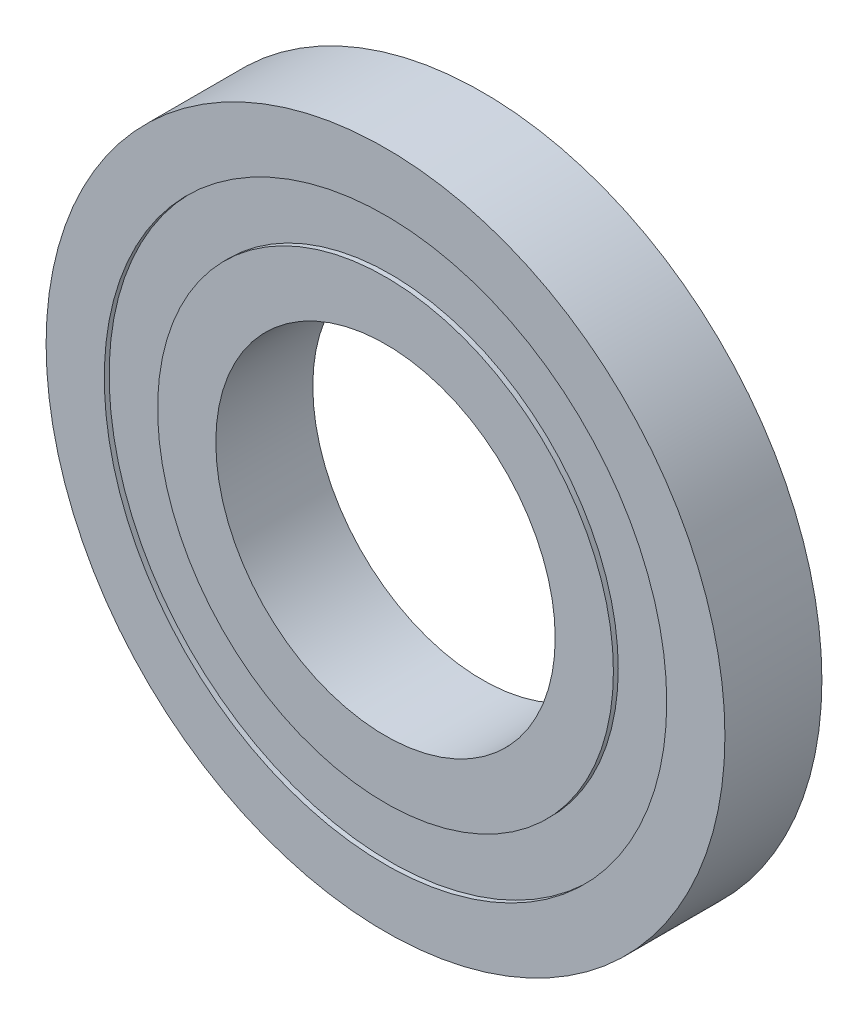
ISO-10303-21;
HEADER;
FILE_DESCRIPTION(('STEP AP214'),'2;1');
FILE_NAME('part.step','',(''),(''),'','','');
FILE_SCHEMA(('AUTOMOTIVE_DESIGN { 1 0 10303 214 1 1 1 1 }'));
ENDSEC;
DATA;
#1=APPLICATION_CONTEXT('core data for automotive mechanical design processes');
#2=APPLICATION_PROTOCOL_DEFINITION('international standard','automotive_design',2000,#1);
#3=PRODUCT_CONTEXT('',#1,'mechanical');
#4=PRODUCT('Part','Part','',(#3));
#5=PRODUCT_RELATED_PRODUCT_CATEGORY('part','',(#4));
#6=PRODUCT_DEFINITION_FORMATION('','',#4);
#7=PRODUCT_DEFINITION_CONTEXT('part definition',#1,'design');
#8=PRODUCT_DEFINITION('design','',#6,#7);
#9=PRODUCT_DEFINITION_SHAPE('','',#8);
#10=(LENGTH_UNIT() NAMED_UNIT(*) SI_UNIT(.MILLI.,.METRE.));
#11=(NAMED_UNIT(*) PLANE_ANGLE_UNIT() SI_UNIT($,.RADIAN.));
#12=(NAMED_UNIT(*) SI_UNIT($,.STERADIAN.) SOLID_ANGLE_UNIT());
#13=UNCERTAINTY_MEASURE_WITH_UNIT(LENGTH_MEASURE(1.E-05),#10,'distance_accuracy_value','');
#14=(GEOMETRIC_REPRESENTATION_CONTEXT(3) GLOBAL_UNCERTAINTY_ASSIGNED_CONTEXT((#13)) GLOBAL_UNIT_ASSIGNED_CONTEXT((#10,
#11,#12)) REPRESENTATION_CONTEXT('',''));
#15=CARTESIAN_POINT('',(0.,0.,0.));
#16=DIRECTION('',(0.,0.,1.));
#17=DIRECTION('',(1.,0.,0.));
#18=AXIS2_PLACEMENT_3D('',#15,#16,#17);
#19=CARTESIAN_POINT('',(0.,0.,10.));
#20=DIRECTION('',(0.,0.,-1.));
#21=DIRECTION('',(-1.,0.,0.));
#22=AXIS2_PLACEMENT_3D('',#19,#20,#21);
#23=CYLINDRICAL_SURFACE('',#22,23.5);
#24=CARTESIAN_POINT('',(0.,0.,0.));
#25=DIRECTION('',(0.,0.,1.));
#26=DIRECTION('',(1.,0.,0.));
#27=AXIS2_PLACEMENT_3D('',#24,#25,#26);
#28=CIRCLE('',#27,23.5);
#29=CARTESIAN_POINT('',(23.5,0.,0.));
#30=VERTEX_POINT('',#29);
#31=EDGE_CURVE('E61',#30,#30,#28,.T.);
#32=ORIENTED_EDGE('',*,*,#31,.T.);
#33=EDGE_LOOP('',(#32));
#34=FACE_BOUND('',#33,.T.);
#35=CARTESIAN_POINT('',(0.,0.,0.5));
#36=DIRECTION('',(0.,0.,1.));
#37=DIRECTION('',(1.,0.,0.));
#38=AXIS2_PLACEMENT_3D('',#35,#36,#37);
#39=CIRCLE('',#38,23.5);
#40=CARTESIAN_POINT('',(23.5,0.,0.5));
#41=VERTEX_POINT('',#40);
#42=EDGE_CURVE('E11',#41,#41,#39,.T.);
#43=ORIENTED_EDGE('',*,*,#42,.F.);
#44=EDGE_LOOP('',(#43));
#45=FACE_BOUND('',#44,.T.);
#46=ADVANCED_FACE('F45',(#34,#45),#23,.T.);
#47=CARTESIAN_POINT('',(0.,0.,10.));
#48=DIRECTION('',(0.,0.,-1.));
#49=DIRECTION('',(-1.,0.,0.));
#50=AXIS2_PLACEMENT_3D('',#47,#48,#49);
#51=CYLINDRICAL_SURFACE('',#50,17.5);
#52=CARTESIAN_POINT('',(0.,0.,10.));
#53=DIRECTION('',(0.,0.,1.));
#54=DIRECTION('',(1.,0.,0.));
#55=AXIS2_PLACEMENT_3D('',#52,#53,#54);
#56=CIRCLE('',#55,17.5);
#57=CARTESIAN_POINT('',(17.5,0.,10.));
#58=VERTEX_POINT('',#57);
#59=EDGE_CURVE('E56',#58,#58,#56,.T.);
#60=ORIENTED_EDGE('',*,*,#59,.T.);
#61=EDGE_LOOP('',(#60));
#62=FACE_BOUND('',#61,.T.);
#63=CARTESIAN_POINT('',(0.,0.,0.));
#64=DIRECTION('',(0.,0.,1.));
#65=DIRECTION('',(1.,0.,0.));
#66=AXIS2_PLACEMENT_3D('',#63,#64,#65);
#67=CIRCLE('',#66,17.5);
#68=CARTESIAN_POINT('',(17.5,0.,0.));
#69=VERTEX_POINT('',#68);
#70=EDGE_CURVE('E65',#69,#69,#67,.T.);
#71=ORIENTED_EDGE('',*,*,#70,.F.);
#72=EDGE_LOOP('',(#71));
#73=FACE_BOUND('',#72,.T.);
#74=ADVANCED_FACE('F47',(#62,#73),#51,.F.);
#75=CARTESIAN_POINT('',(0.,0.,9.5));
#76=DIRECTION('',(0.,0.,1.));
#77=DIRECTION('',(1.,0.,0.));
#78=AXIS2_PLACEMENT_3D('',#75,#76,#77);
#79=CIRCLE('',#78,23.5);
#80=CARTESIAN_POINT('',(23.5,0.,9.5));
#81=VERTEX_POINT('',#80);
#82=EDGE_CURVE('E67',#81,#81,#79,.T.);
#83=ORIENTED_EDGE('',*,*,#82,.T.);
#84=EDGE_LOOP('',(#83));
#85=FACE_BOUND('',#84,.T.);
#86=CARTESIAN_POINT('',(0.,0.,10.));
#87=DIRECTION('',(0.,0.,1.));
#88=DIRECTION('',(1.,0.,0.));
#89=AXIS2_PLACEMENT_3D('',#86,#87,#88);
#90=CIRCLE('',#89,23.5);
#91=CARTESIAN_POINT('',(23.5,0.,10.));
#92=VERTEX_POINT('',#91);
#93=EDGE_CURVE('E52',#92,#92,#90,.T.);
#94=ORIENTED_EDGE('',*,*,#93,.F.);
#95=EDGE_LOOP('',(#94));
#96=FACE_BOUND('',#95,.T.);
#97=ADVANCED_FACE('F87',(#85,#96),#23,.T.);
#98=CARTESIAN_POINT('',(0.,0.,10.));
#99=DIRECTION('',(0.,0.,1.));
#100=DIRECTION('',(1.,0.,0.));
#101=AXIS2_PLACEMENT_3D('',#98,#99,#100);
#102=PLANE('',#101);
#103=ORIENTED_EDGE('',*,*,#59,.F.);
#104=EDGE_LOOP('',(#103));
#105=FACE_BOUND('',#104,.T.);
#106=ORIENTED_EDGE('',*,*,#93,.T.);
#107=EDGE_LOOP('',(#106));
#108=FACE_BOUND('',#107,.T.);
#109=ADVANCED_FACE('F76',(#105,#108),#102,.T.);
#110=CARTESIAN_POINT('',(0.,0.,0.));
#111=DIRECTION('',(0.,0.,1.));
#112=DIRECTION('',(1.,0.,0.));
#113=AXIS2_PLACEMENT_3D('',#110,#111,#112);
#114=PLANE('',#113);
#115=ORIENTED_EDGE('',*,*,#70,.T.);
#116=EDGE_LOOP('',(#115));
#117=FACE_BOUND('',#116,.T.);
#118=ORIENTED_EDGE('',*,*,#31,.F.);
#119=EDGE_LOOP('',(#118));
#120=FACE_BOUND('',#119,.T.);
#121=ADVANCED_FACE('F73',(#117,#120),#114,.F.);
#122=CARTESIAN_POINT('',(0.,0.,9.5));
#123=DIRECTION('',(0.,0.,1.));
#124=DIRECTION('',(1.,0.,0.));
#125=AXIS2_PLACEMENT_3D('',#122,#123,#124);
#126=PLANE('',#125);
#127=ORIENTED_EDGE('',*,*,#82,.F.);
#128=EDGE_LOOP('',(#127));
#129=FACE_BOUND('',#128,.T.);
#130=CARTESIAN_POINT('',(0.,0.,9.5));
#131=DIRECTION('',(0.,0.,1.));
#132=DIRECTION('',(1.,0.,0.));
#133=AXIS2_PLACEMENT_3D('',#130,#131,#132);
#134=CIRCLE('',#133,29.);
#135=CARTESIAN_POINT('',(29.,0.,9.5));
#136=VERTEX_POINT('',#135);
#137=EDGE_CURVE('E104',#136,#136,#134,.F.);
#138=ORIENTED_EDGE('',*,*,#137,.F.);
#139=EDGE_LOOP('',(#138));
#140=FACE_BOUND('',#139,.T.);
#141=ADVANCED_FACE('F75',(#129,#140),#126,.T.);
#142=CARTESIAN_POINT('',(0.,0.,0.5));
#143=DIRECTION('',(0.,0.,1.));
#144=DIRECTION('',(1.,0.,0.));
#145=AXIS2_PLACEMENT_3D('',#142,#143,#144);
#146=PLANE('',#145);
#147=ORIENTED_EDGE('',*,*,#42,.T.);
#148=EDGE_LOOP('',(#147));
#149=FACE_BOUND('',#148,.T.);
#150=CARTESIAN_POINT('',(0.,0.,0.5));
#151=DIRECTION('',(0.,0.,1.));
#152=DIRECTION('',(1.,0.,0.));
#153=AXIS2_PLACEMENT_3D('',#150,#151,#152);
#154=CIRCLE('',#153,29.);
#155=CARTESIAN_POINT('',(29.,0.,0.5));
#156=VERTEX_POINT('',#155);
#157=EDGE_CURVE('E101',#156,#156,#154,.T.);
#158=ORIENTED_EDGE('',*,*,#157,.F.);
#159=EDGE_LOOP('',(#158));
#160=FACE_BOUND('',#159,.T.);
#161=ADVANCED_FACE('F84',(#149,#160),#146,.F.);
#162=CARTESIAN_POINT('',(0.,0.,10.));
#163=DIRECTION('',(0.,0.,-1.));
#164=DIRECTION('',(-1.,0.,0.));
#165=AXIS2_PLACEMENT_3D('',#162,#163,#164);
#166=CYLINDRICAL_SURFACE('',#165,29.);
#167=CARTESIAN_POINT('',(0.,0.,0.));
#168=DIRECTION('',(0.,0.,1.));
#169=DIRECTION('',(1.,0.,0.));
#170=AXIS2_PLACEMENT_3D('',#167,#168,#169);
#171=CIRCLE('',#170,29.);
#172=CARTESIAN_POINT('',(29.,0.,0.));
#173=VERTEX_POINT('',#172);
#174=EDGE_CURVE('E113',#173,#173,#171,.T.);
#175=ORIENTED_EDGE('',*,*,#174,.F.);
#176=EDGE_LOOP('',(#175));
#177=FACE_BOUND('',#176,.T.);
#178=ORIENTED_EDGE('',*,*,#157,.T.);
#179=EDGE_LOOP('',(#178));
#180=FACE_BOUND('',#179,.T.);
#181=ADVANCED_FACE('F143',(#177,#180),#166,.F.);
#182=ORIENTED_EDGE('',*,*,#137,.T.);
#183=EDGE_LOOP('',(#182));
#184=FACE_BOUND('',#183,.T.);
#185=CARTESIAN_POINT('',(0.,0.,10.));
#186=DIRECTION('',(0.,0.,1.));
#187=DIRECTION('',(1.,0.,0.));
#188=AXIS2_PLACEMENT_3D('',#185,#186,#187);
#189=CIRCLE('',#188,29.);
#190=CARTESIAN_POINT('',(29.,0.,10.));
#191=VERTEX_POINT('',#190);
#192=EDGE_CURVE('E112',#191,#191,#189,.T.);
#193=ORIENTED_EDGE('',*,*,#192,.T.);
#194=EDGE_LOOP('',(#193));
#195=FACE_BOUND('',#194,.T.);
#196=ADVANCED_FACE('F121',(#184,#195),#166,.F.);
#197=CARTESIAN_POINT('',(0.,0.,10.));
#198=DIRECTION('',(0.,0.,-1.));
#199=DIRECTION('',(-1.,0.,0.));
#200=AXIS2_PLACEMENT_3D('',#197,#198,#199);
#201=CYLINDRICAL_SURFACE('',#200,35.);
#202=CARTESIAN_POINT('',(0.,0.,10.));
#203=DIRECTION('',(0.,0.,1.));
#204=DIRECTION('',(1.,0.,0.));
#205=AXIS2_PLACEMENT_3D('',#202,#203,#204);
#206=CIRCLE('',#205,35.);
#207=CARTESIAN_POINT('',(35.,0.,10.));
#208=VERTEX_POINT('',#207);
#209=EDGE_CURVE('E108',#208,#208,#206,.T.);
#210=ORIENTED_EDGE('',*,*,#209,.F.);
#211=EDGE_LOOP('',(#210));
#212=FACE_BOUND('',#211,.T.);
#213=CARTESIAN_POINT('',(0.,0.,0.));
#214=DIRECTION('',(0.,0.,1.));
#215=DIRECTION('',(1.,0.,0.));
#216=AXIS2_PLACEMENT_3D('',#213,#214,#215);
#217=CIRCLE('',#216,35.);
#218=CARTESIAN_POINT('',(35.,0.,0.));
#219=VERTEX_POINT('',#218);
#220=EDGE_CURVE('E109',#219,#219,#217,.T.);
#221=ORIENTED_EDGE('',*,*,#220,.T.);
#222=EDGE_LOOP('',(#221));
#223=FACE_BOUND('',#222,.T.);
#224=ADVANCED_FACE('F127',(#212,#223),#201,.T.);
#225=CARTESIAN_POINT('',(0.,0.,10.));
#226=DIRECTION('',(0.,0.,1.));
#227=DIRECTION('',(1.,0.,0.));
#228=AXIS2_PLACEMENT_3D('',#225,#226,#227);
#229=PLANE('',#228);
#230=ORIENTED_EDGE('',*,*,#192,.F.);
#231=EDGE_LOOP('',(#230));
#232=FACE_BOUND('',#231,.T.);
#233=ORIENTED_EDGE('',*,*,#209,.T.);
#234=EDGE_LOOP('',(#233));
#235=FACE_BOUND('',#234,.T.);
#236=ADVANCED_FACE('F123',(#232,#235),#229,.T.);
#237=CARTESIAN_POINT('',(0.,0.,0.));
#238=DIRECTION('',(0.,0.,1.));
#239=DIRECTION('',(1.,0.,0.));
#240=AXIS2_PLACEMENT_3D('',#237,#238,#239);
#241=PLANE('',#240);
#242=ORIENTED_EDGE('',*,*,#174,.T.);
#243=EDGE_LOOP('',(#242));
#244=FACE_BOUND('',#243,.T.);
#245=ORIENTED_EDGE('',*,*,#220,.F.);
#246=EDGE_LOOP('',(#245));
#247=FACE_BOUND('',#246,.T.);
#248=ADVANCED_FACE('F126',(#244,#247),#241,.F.);
#249=CLOSED_SHELL('',(#46,#74,#97,#109,#121,#141,#161,#181,#196,#224,#236,#248));
#250=MANIFOLD_SOLID_BREP('B2',#249);
#251=ADVANCED_BREP_SHAPE_REPRESENTATION('',(#18,#250),#14);
#252=SHAPE_DEFINITION_REPRESENTATION(#9,#251);
ENDSEC;
END-ISO-10303-21;
